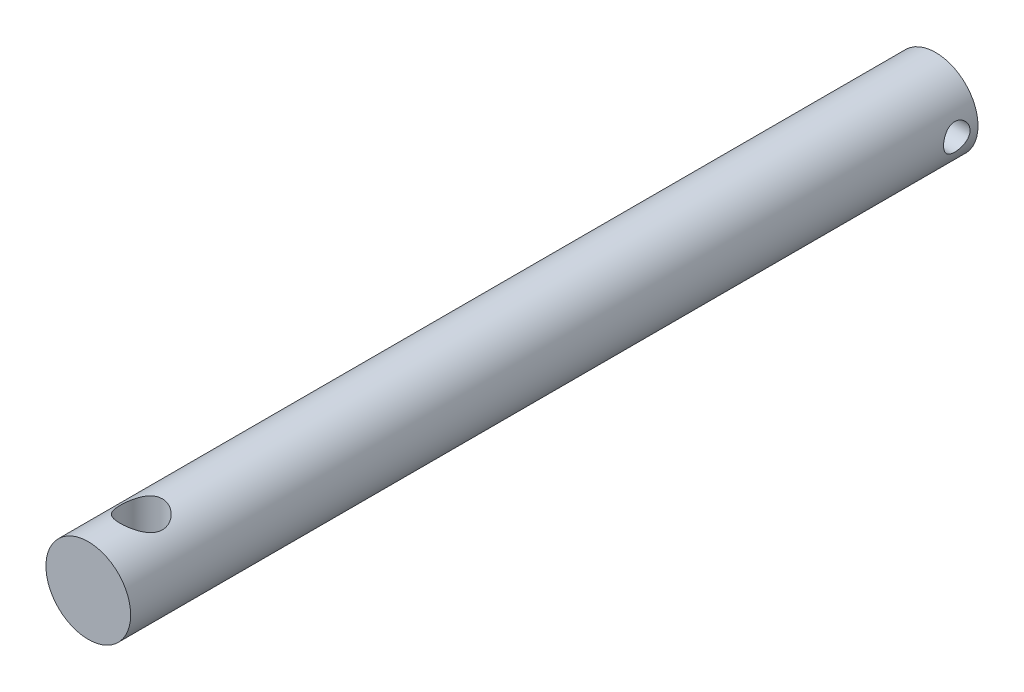
ISO-10303-21;
HEADER;
FILE_DESCRIPTION(('STEP AP214'),'2;1');
FILE_NAME('part.step','',(''),(''),'','','');
FILE_SCHEMA(('AUTOMOTIVE_DESIGN { 1 0 10303 214 1 1 1 1 }'));
ENDSEC;
DATA;
#1=APPLICATION_CONTEXT('core data for automotive mechanical design processes');
#2=APPLICATION_PROTOCOL_DEFINITION('international standard','automotive_design',2000,#1);
#3=PRODUCT_CONTEXT('',#1,'mechanical');
#4=PRODUCT('Part','Part','',(#3));
#5=PRODUCT_RELATED_PRODUCT_CATEGORY('part','',(#4));
#6=PRODUCT_DEFINITION_FORMATION('','',#4);
#7=PRODUCT_DEFINITION_CONTEXT('part definition',#1,'design');
#8=PRODUCT_DEFINITION('design','',#6,#7);
#9=PRODUCT_DEFINITION_SHAPE('','',#8);
#10=(LENGTH_UNIT() NAMED_UNIT(*) SI_UNIT(.MILLI.,.METRE.));
#11=(NAMED_UNIT(*) PLANE_ANGLE_UNIT() SI_UNIT($,.RADIAN.));
#12=(NAMED_UNIT(*) SI_UNIT($,.STERADIAN.) SOLID_ANGLE_UNIT());
#13=UNCERTAINTY_MEASURE_WITH_UNIT(LENGTH_MEASURE(1.E-05),#10,'distance_accuracy_value','');
#14=(GEOMETRIC_REPRESENTATION_CONTEXT(3) GLOBAL_UNCERTAINTY_ASSIGNED_CONTEXT((#13)) GLOBAL_UNIT_ASSIGNED_CONTEXT((#10,
#11,#12)) REPRESENTATION_CONTEXT('',''));
#15=CARTESIAN_POINT('',(0.,0.,0.));
#16=DIRECTION('',(0.,0.,1.));
#17=DIRECTION('',(1.,0.,0.));
#18=AXIS2_PLACEMENT_3D('',#15,#16,#17);
#19=CARTESIAN_POINT('',(0.,0.,160.));
#20=DIRECTION('',(0.,0.,-1.));
#21=DIRECTION('',(-1.,0.,0.));
#22=AXIS2_PLACEMENT_3D('',#19,#20,#21);
#23=CYLINDRICAL_SURFACE('',#22,8.);
#24=CARTESIAN_POINT('',(0.,8.,146.));
#25=CARTESIAN_POINT('',(-0.105191216468488,7.99999964432188,146.000000404848));
#26=CARTESIAN_POINT('',(-0.210389995368427,7.99792027620652,146.004154457315));
#27=CARTESIAN_POINT('',(-0.420011249701337,7.98965597150982,146.020722078099));
#28=CARTESIAN_POINT('',(-0.524433367425621,7.98346924887743,146.03313923957));
#29=CARTESIAN_POINT('',(-0.731828138370608,7.96713597659603,146.066113514695));
#30=CARTESIAN_POINT('',(-0.834798506711921,7.95698378017499,146.086682236657));
#31=CARTESIAN_POINT('',(-1.0384152051955,7.93298382243633,146.135717207556));
#32=CARTESIAN_POINT('',(-1.13906056699381,7.91913455043164,146.164186685064));
#33=CARTESIAN_POINT('',(-1.43561775388138,7.87265974292142,146.260748231118));
#34=CARTESIAN_POINT('',(-1.62719620658471,7.83501976471674,146.340162980847));
#35=CARTESIAN_POINT('',(-1.99392146995423,7.74982886318844,146.526289041088));
#36=CARTESIAN_POINT('',(-2.16906957469775,7.70227872135526,146.632998199381));
#37=CARTESIAN_POINT('',(-2.51002321260363,7.59825056785885,146.878069822599));
#38=CARTESIAN_POINT('',(-2.67462250306453,7.54140647262265,147.017956688194));
#39=CARTESIAN_POINT('',(-2.97911611963432,7.42640030348014,147.322075137586));
#40=CARTESIAN_POINT('',(-3.11899161990725,7.36823726296469,147.486325099043));
#41=CARTESIAN_POINT('',(-3.38102385527716,7.25195135134797,147.84997898713));
#42=CARTESIAN_POINT('',(-3.50096528772936,7.19418138823907,148.051121304275));
#43=CARTESIAN_POINT('',(-3.65378721735264,7.11709930290977,148.367934539954));
#44=CARTESIAN_POINT('',(-3.70022392693972,7.09299422837207,148.476094662807));
#45=CARTESIAN_POINT('',(-3.78359067078058,7.04887690211805,148.696800971079));
#46=CARTESIAN_POINT('',(-3.82052633371566,7.02886222858683,148.809344513922));
#47=CARTESIAN_POINT('',(-3.88251046204455,6.9948044998643,149.031194219306));
#48=CARTESIAN_POINT('',(-3.9081340887804,6.9804776446802,149.140296419165));
#49=CARTESIAN_POINT('',(-3.95018060072942,6.95677065788592,149.36074052282));
#50=CARTESIAN_POINT('',(-3.96660836750271,6.9473879018896,149.472081205753));
#51=CARTESIAN_POINT('',(-3.99001913809429,6.93396933490057,149.696006093466));
#52=CARTESIAN_POINT('',(-3.99700782997253,6.92993030376772,149.808589508088));
#53=CARTESIAN_POINT('',(-4.00144340059851,6.92737022415464,150.034000478039));
#54=CARTESIAN_POINT('',(-3.99889118971828,6.92884864921081,150.146828009047));
#55=CARTESIAN_POINT('',(-3.98516575152016,6.93675038555111,150.358164378446));
#56=CARTESIAN_POINT('',(-3.97506329407581,6.94255931040712,150.456767439572));
#57=CARTESIAN_POINT('',(-3.94763759493625,6.95818925294571,150.652651612166));
#58=CARTESIAN_POINT('',(-3.9303120853467,6.96801153072176,150.74993229852));
#59=CARTESIAN_POINT('',(-3.86777248849785,7.00304835203764,151.0387791329));
#60=CARTESIAN_POINT('',(-3.8119855502641,7.03383903740602,151.227495457081));
#61=CARTESIAN_POINT('',(-3.6728359957252,7.10749917506982,151.596946332771));
#62=CARTESIAN_POINT('',(-3.58886132884633,7.15063327143764,151.777392575348));
#63=CARTESIAN_POINT('',(-3.39616568981264,7.2441365265382,152.122530187015));
#64=CARTESIAN_POINT('',(-3.28743360222608,7.29450893132236,152.287214432065));
#65=CARTESIAN_POINT('',(-3.03227252755196,7.40452458073482,152.618082881705));
#66=CARTESIAN_POINT('',(-2.88281182497071,7.46453347888883,152.781809570708));
#67=CARTESIAN_POINT('',(-2.55818830727484,7.58191186589975,153.0829596065));
#68=CARTESIAN_POINT('',(-2.38301327894515,7.63928008344307,153.220370382475));
#69=CARTESIAN_POINT('',(-2.09944472683199,7.72027607686169,153.406753030214));
#70=CARTESIAN_POINT('',(-1.9989679987013,7.74696304862188,153.466681759753));
#71=CARTESIAN_POINT('',(-1.79256850112002,7.79730441532266,153.577766478777));
#72=CARTESIAN_POINT('',(-1.68664805204876,7.82096008757468,153.628926166398));
#73=CARTESIAN_POINT('',(-1.47010242051538,7.86454042959534,153.721919122373));
#74=CARTESIAN_POINT('',(-1.35947915341347,7.88446660078232,153.763756145133));
#75=CARTESIAN_POINT('',(-1.13432950721216,7.91999221203723,153.837619938552));
#76=CARTESIAN_POINT('',(-1.01980357880327,7.9355921498224,153.869647837759));
#77=CARTESIAN_POINT('',(-0.797438403015323,7.96087677585623,153.921226847855));
#78=CARTESIAN_POINT('',(-0.689830906854559,7.9709443603734,153.941591597057));
#79=CARTESIAN_POINT('',(-0.472998720376374,7.98674429615844,153.973446448242));
#80=CARTESIAN_POINT('',(-0.363774173887717,7.99247703065614,153.984937334737));
#81=CARTESIAN_POINT('',(-0.144648447401167,7.99944300548302,153.998890471544));
#82=CARTESIAN_POINT('',(-0.0347475425961409,8.00067796839692,154.001356178379));
#83=CARTESIAN_POINT('',(0.184837638972489,7.99861804620746,153.99723575789));
#84=CARTESIAN_POINT('',(0.294521925108022,7.99532336157662,153.990650031163));
#85=CARTESIAN_POINT('',(0.504259611746538,7.98472734940324,153.969376430473));
#86=CARTESIAN_POINT('',(0.604398259266984,7.97775776257091,153.955358930896));
#87=CARTESIAN_POINT('',(0.803035609307671,7.96021983565122,153.919863600336));
#88=CARTESIAN_POINT('',(0.901533743070591,7.94965027363514,153.898383236207));
#89=CARTESIAN_POINT('',(1.19351737727533,7.91289127905722,153.8230648264));
#90=CARTESIAN_POINT('',(1.38368108667205,7.88164133135127,153.758329859409));
#91=CARTESIAN_POINT('',(1.75558493783057,7.80736894774679,153.600001891094));
#92=CARTESIAN_POINT('',(1.93692876519228,7.76403545540106,153.505636690828));
#93=CARTESIAN_POINT('',(2.28183826656571,7.66975878800211,153.29156896574));
#94=CARTESIAN_POINT('',(2.44539632212196,7.61881237399843,153.171855647368));
#95=CARTESIAN_POINT('',(2.76706877708067,7.50833088367007,152.896966880297));
#96=CARTESIAN_POINT('',(2.92307134240143,7.44844369061623,152.739463462741));
#97=CARTESIAN_POINT('',(3.20744226426285,7.33048735856256,152.400264434745));
#98=CARTESIAN_POINT('',(3.33579150415336,7.27241950081065,152.218552228397));
#99=CARTESIAN_POINT('',(3.50772930633182,7.19028164087442,151.926005985578));
#100=CARTESIAN_POINT('',(3.56261578679478,7.16316684054652,151.822516241564));
#101=CARTESIAN_POINT('',(3.6633461615428,7.11217812644118,151.610481564684));
#102=CARTESIAN_POINT('',(3.70919441458264,7.08830265221425,151.501939099905));
#103=CARTESIAN_POINT('',(3.79131200961918,7.04472262103752,151.280578354636));
#104=CARTESIAN_POINT('',(3.82758904080802,7.02501471854545,151.167763590205));
#105=CARTESIAN_POINT('',(3.89012004539429,6.9905825381999,150.938647210928));
#106=CARTESIAN_POINT('',(3.91637557070638,6.9758574887497,150.822346138978));
#107=CARTESIAN_POINT('',(3.95643062416587,6.9532102561999,150.598587866837));
#108=CARTESIAN_POINT('',(3.97118378192521,6.94477079792059,150.491353167092));
#109=CARTESIAN_POINT('',(3.99195118317072,6.93285441469714,150.275772329799));
#110=CARTESIAN_POINT('',(3.99796634225491,6.92937696981658,150.167426309899));
#111=CARTESIAN_POINT('',(4.00116308319383,6.92753208063798,149.95059250327));
#112=CARTESIAN_POINT('',(3.99834777004019,6.92916284018069,149.842104779777));
#113=CARTESIAN_POINT('',(3.98394653809982,6.9374509348198,149.625938852886));
#114=CARTESIAN_POINT('',(3.97236097836303,6.94410806413885,149.518260616531));
#115=CARTESIAN_POINT('',(3.92770249100378,6.9695287958286,149.218199862959));
#116=CARTESIAN_POINT('',(3.88483285002043,6.99372760142387,149.027634132686));
#117=CARTESIAN_POINT('',(3.77270184038046,7.05483682415845,148.656731497447));
#118=CARTESIAN_POINT('',(3.70343198216887,7.09175132993569,148.476397904296));
#119=CARTESIAN_POINT('',(3.53526338936953,7.17714225279384,148.117511446486));
#120=CARTESIAN_POINT('',(3.43468670285355,7.22622883383996,147.939892224238));
#121=CARTESIAN_POINT('',(3.20860173383709,7.32941332742359,147.602898021723));
#122=CARTESIAN_POINT('',(3.08308048046464,7.38351383930109,147.443532601459));
#123=CARTESIAN_POINT('',(2.79282250805388,7.49849148240842,147.127437090961));
#124=CARTESIAN_POINT('',(2.62517402605098,7.55939328373464,146.973380070376));
#125=CARTESIAN_POINT('',(2.26458287075638,7.67511613929542,146.694931577187));
#126=CARTESIAN_POINT('',(2.0716266499056,7.72993390744395,146.570556094758));
#127=CARTESIAN_POINT('',(1.76603106757847,7.80335210517359,146.409095750585));
#128=CARTESIAN_POINT('',(1.66100410373828,7.82643367929071,146.359306358591));
#129=CARTESIAN_POINT('',(1.44639623629744,7.8689179624278,146.268851052999));
#130=CARTESIAN_POINT('',(1.33681760142932,7.88832247803741,146.228180657302));
#131=CARTESIAN_POINT('',(1.11415600876093,7.92283587265691,146.156523655566));
#132=CARTESIAN_POINT('',(1.00108129646084,7.93795411409434,146.125515928613));
#133=CARTESIAN_POINT('',(0.772189766950839,7.96347694583625,146.073489919984));
#134=CARTESIAN_POINT('',(0.65637467030461,7.97388441530453,146.052465536228));
#135=CARTESIAN_POINT('',(0.450433316283297,7.98781110043795,146.024420378801));
#136=CARTESIAN_POINT('',(0.360660623567805,7.99237392421377,146.015270610824));
#137=CARTESIAN_POINT('',(0.180593821057083,7.99846856848792,146.003060163622));
#138=CARTESIAN_POINT('',(0.0902996969389638,8.00000030532612,145.999999652465));
#139=CARTESIAN_POINT('',(0.,8.,146.));
#140=B_SPLINE_CURVE_WITH_KNOTS('',3,(#24,#25,#26,#27,#28,#29,#30,#31,#32,#33,#34,#35,#36,#37,
#38,#39,#40,#41,#42,#43,#44,#45,#46,#47,#48,#49,#50,#51,#52,#53,#54,#55,#56,#57,#58,#59,#60,#61,
#62,#63,#64,#65,#66,#67,#68,#69,#70,#71,#72,#73,#74,#75,#76,#77,#78,#79,#80,#81,#82,#83,#84,#85,
#86,#87,#88,#89,#90,#91,#92,#93,#94,#95,#96,#97,#98,#99,#100,#101,#102,#103,#104,#105,#106,#107,
#108,#109,#110,#111,#112,#113,#114,#115,#116,#117,#118,#119,#120,#121,#122,#123,#124,#125,#126,
#127,#128,#129,#130,#131,#132,#133,#134,#135,#136,#137,#138,#139),.UNSPECIFIED.,.T.,.F.,(4,2,2,
2,2,2,2,2,2,2,2,2,2,2,2,2,2,2,2,2,2,2,2,2,2,2,2,2,2,2,2,2,2,2,2,2,2,2,2,2,2,2,2,2,2,2,2,2,2,2,2,
2,2,2,2,2,2,4),(0.,0.315484235719913,0.631105747230255,0.947178346952281,1.26338029745355,
1.89263632058596,2.52184274094304,3.18911473348914,3.8568926492329,4.57645675584685,
4.93648208726458,5.29629363598335,5.63476191634053,5.97305035229577,6.31113484191768,
6.64918707308225,6.9466914865286,7.24428938086225,7.83905304157542,8.44767049128776,
9.05656173495714,9.74265853790342,10.4290822684957,10.7886699173095,11.1481055433964,
11.5073961555811,11.8666454155399,12.1961419049363,12.5256092612256,12.8549504227676,
13.184277008843,13.4879760335491,13.791778244799,14.3988188497914,15.0232162256701,
15.6478800144877,16.33388641032,17.0203655291613,17.3806820308649,17.7408243397693,
18.1006764355618,18.4604727825931,18.7857371805984,19.1109674938046,19.4360834615764,
19.7611861199665,20.3488209353336,20.9366448769134,21.5639619965908,22.1916061711246,
22.8955134356509,23.5997990605888,23.9548906509477,24.309807324981,24.6639426811876,
25.0178613011449,25.2886761616556,25.5594984967416),.UNSPECIFIED.);
#141=CARTESIAN_POINT('',(0.,8.,146.));
#142=VERTEX_POINT('',#141);
#143=EDGE_CURVE('E52',#142,#142,#140,.T.);
#144=ORIENTED_EDGE('',*,*,#143,.F.);
#145=EDGE_LOOP('',(#144));
#146=FACE_BOUND('',#145,.T.);
#147=CARTESIAN_POINT('',(0.,0.,0.));
#148=DIRECTION('',(0.,0.,1.));
#149=DIRECTION('',(1.,0.,0.));
#150=AXIS2_PLACEMENT_3D('',#147,#148,#149);
#151=CIRCLE('',#150,8.);
#152=CARTESIAN_POINT('',(8.,0.,0.));
#153=VERTEX_POINT('',#152);
#154=EDGE_CURVE('E47',#153,#153,#151,.T.);
#155=ORIENTED_EDGE('',*,*,#154,.T.);
#156=EDGE_LOOP('',(#155));
#157=FACE_BOUND('',#156,.T.);
#158=CARTESIAN_POINT('',(0.,0.,160.));
#159=DIRECTION('',(0.,0.,1.));
#160=DIRECTION('',(1.,0.,0.));
#161=AXIS2_PLACEMENT_3D('',#158,#159,#160);
#162=CIRCLE('',#161,8.);
#163=CARTESIAN_POINT('',(8.,0.,160.));
#164=VERTEX_POINT('',#163);
#165=EDGE_CURVE('E10',#164,#164,#162,.T.);
#166=ORIENTED_EDGE('',*,*,#165,.F.);
#167=EDGE_LOOP('',(#166));
#168=FACE_BOUND('',#167,.T.);
#169=CARTESIAN_POINT('',(0.,-8.,146.));
#170=CARTESIAN_POINT('',(0.105191216468488,-7.99999964432188,146.000000404848));
#171=CARTESIAN_POINT('',(0.210389995368427,-7.99792027620652,146.004154457315));
#172=CARTESIAN_POINT('',(0.420011249701337,-7.98965597150982,146.020722078099));
#173=CARTESIAN_POINT('',(0.524433367425621,-7.98346924887743,146.03313923957));
#174=CARTESIAN_POINT('',(0.731828138370608,-7.96713597659603,146.066113514695));
#175=CARTESIAN_POINT('',(0.834798506711921,-7.95698378017499,146.086682236657));
#176=CARTESIAN_POINT('',(1.0384152051955,-7.93298382243633,146.135717207556));
#177=CARTESIAN_POINT('',(1.13906056699381,-7.91913455043164,146.164186685064));
#178=CARTESIAN_POINT('',(1.43561775388138,-7.87265974292142,146.260748231118));
#179=CARTESIAN_POINT('',(1.62719620658471,-7.83501976471674,146.340162980847));
#180=CARTESIAN_POINT('',(1.99392146995423,-7.74982886318844,146.526289041088));
#181=CARTESIAN_POINT('',(2.16906957469775,-7.70227872135526,146.632998199381));
#182=CARTESIAN_POINT('',(2.51002321260363,-7.59825056785885,146.878069822599));
#183=CARTESIAN_POINT('',(2.67462250306453,-7.54140647262265,147.017956688194));
#184=CARTESIAN_POINT('',(2.97911611963432,-7.42640030348014,147.322075137586));
#185=CARTESIAN_POINT('',(3.11899161990725,-7.36823726296469,147.486325099043));
#186=CARTESIAN_POINT('',(3.38102385527716,-7.25195135134797,147.84997898713));
#187=CARTESIAN_POINT('',(3.50096528772936,-7.19418138823907,148.051121304275));
#188=CARTESIAN_POINT('',(3.65378721735264,-7.11709930290977,148.367934539954));
#189=CARTESIAN_POINT('',(3.70022392693972,-7.09299422837207,148.476094662807));
#190=CARTESIAN_POINT('',(3.78359067078058,-7.04887690211805,148.696800971079));
#191=CARTESIAN_POINT('',(3.82052633371566,-7.02886222858683,148.809344513922));
#192=CARTESIAN_POINT('',(3.88251046204455,-6.9948044998643,149.031194219306));
#193=CARTESIAN_POINT('',(3.9081340887804,-6.9804776446802,149.140296419165));
#194=CARTESIAN_POINT('',(3.95018060072942,-6.95677065788592,149.36074052282));
#195=CARTESIAN_POINT('',(3.96660836750271,-6.9473879018896,149.472081205753));
#196=CARTESIAN_POINT('',(3.99001913809429,-6.93396933490057,149.696006093466));
#197=CARTESIAN_POINT('',(3.99700782997253,-6.92993030376772,149.808589508088));
#198=CARTESIAN_POINT('',(4.00144340059851,-6.92737022415464,150.034000478039));
#199=CARTESIAN_POINT('',(3.99889118971828,-6.92884864921081,150.146828009047));
#200=CARTESIAN_POINT('',(3.98516575152016,-6.93675038555111,150.358164378446));
#201=CARTESIAN_POINT('',(3.97506329407581,-6.94255931040712,150.456767439572));
#202=CARTESIAN_POINT('',(3.94763759493625,-6.95818925294571,150.652651612166));
#203=CARTESIAN_POINT('',(3.9303120853467,-6.96801153072176,150.74993229852));
#204=CARTESIAN_POINT('',(3.86777248849785,-7.00304835203764,151.0387791329));
#205=CARTESIAN_POINT('',(3.8119855502641,-7.03383903740602,151.227495457081));
#206=CARTESIAN_POINT('',(3.6728359957252,-7.10749917506982,151.596946332771));
#207=CARTESIAN_POINT('',(3.58886132884633,-7.15063327143764,151.777392575348));
#208=CARTESIAN_POINT('',(3.39616568981264,-7.2441365265382,152.122530187015));
#209=CARTESIAN_POINT('',(3.28743360222608,-7.29450893132236,152.287214432065));
#210=CARTESIAN_POINT('',(3.03227252755196,-7.40452458073482,152.618082881705));
#211=CARTESIAN_POINT('',(2.88281182497071,-7.46453347888883,152.781809570708));
#212=CARTESIAN_POINT('',(2.55818830727484,-7.58191186589975,153.0829596065));
#213=CARTESIAN_POINT('',(2.38301327894515,-7.63928008344307,153.220370382475));
#214=CARTESIAN_POINT('',(2.09944472683199,-7.72027607686169,153.406753030214));
#215=CARTESIAN_POINT('',(1.9989679987013,-7.74696304862188,153.466681759753));
#216=CARTESIAN_POINT('',(1.79256850112002,-7.79730441532266,153.577766478777));
#217=CARTESIAN_POINT('',(1.68664805204876,-7.82096008757468,153.628926166398));
#218=CARTESIAN_POINT('',(1.47010242051538,-7.86454042959534,153.721919122373));
#219=CARTESIAN_POINT('',(1.35947915341347,-7.88446660078232,153.763756145133));
#220=CARTESIAN_POINT('',(1.13432950721216,-7.91999221203723,153.837619938552));
#221=CARTESIAN_POINT('',(1.01980357880327,-7.9355921498224,153.869647837759));
#222=CARTESIAN_POINT('',(0.797438403015323,-7.96087677585623,153.921226847855));
#223=CARTESIAN_POINT('',(0.689830906854559,-7.9709443603734,153.941591597057));
#224=CARTESIAN_POINT('',(0.472998720376374,-7.98674429615844,153.973446448242));
#225=CARTESIAN_POINT('',(0.363774173887717,-7.99247703065614,153.984937334737));
#226=CARTESIAN_POINT('',(0.144648447401167,-7.99944300548302,153.998890471544));
#227=CARTESIAN_POINT('',(0.0347475425961409,-8.00067796839692,154.001356178379));
#228=CARTESIAN_POINT('',(-0.184837638972489,-7.99861804620746,153.99723575789));
#229=CARTESIAN_POINT('',(-0.294521925108022,-7.99532336157662,153.990650031163));
#230=CARTESIAN_POINT('',(-0.504259611746538,-7.98472734940324,153.969376430473));
#231=CARTESIAN_POINT('',(-0.604398259266984,-7.97775776257091,153.955358930896));
#232=CARTESIAN_POINT('',(-0.803035609307671,-7.96021983565122,153.919863600336));
#233=CARTESIAN_POINT('',(-0.901533743070591,-7.94965027363514,153.898383236207));
#234=CARTESIAN_POINT('',(-1.19351737727533,-7.91289127905722,153.8230648264));
#235=CARTESIAN_POINT('',(-1.38368108667205,-7.88164133135127,153.758329859409));
#236=CARTESIAN_POINT('',(-1.75558493783057,-7.80736894774679,153.600001891094));
#237=CARTESIAN_POINT('',(-1.93692876519228,-7.76403545540106,153.505636690828));
#238=CARTESIAN_POINT('',(-2.28183826656571,-7.66975878800211,153.29156896574));
#239=CARTESIAN_POINT('',(-2.44539632212196,-7.61881237399843,153.171855647368));
#240=CARTESIAN_POINT('',(-2.76706877708067,-7.50833088367007,152.896966880297));
#241=CARTESIAN_POINT('',(-2.92307134240143,-7.44844369061623,152.739463462741));
#242=CARTESIAN_POINT('',(-3.20744226426285,-7.33048735856256,152.400264434745));
#243=CARTESIAN_POINT('',(-3.33579150415336,-7.27241950081065,152.218552228397));
#244=CARTESIAN_POINT('',(-3.50772930633182,-7.19028164087442,151.926005985578));
#245=CARTESIAN_POINT('',(-3.56261578679478,-7.16316684054652,151.822516241564));
#246=CARTESIAN_POINT('',(-3.6633461615428,-7.11217812644118,151.610481564684));
#247=CARTESIAN_POINT('',(-3.70919441458264,-7.08830265221425,151.501939099905));
#248=CARTESIAN_POINT('',(-3.79131200961918,-7.04472262103752,151.280578354636));
#249=CARTESIAN_POINT('',(-3.82758904080802,-7.02501471854545,151.167763590205));
#250=CARTESIAN_POINT('',(-3.89012004539429,-6.9905825381999,150.938647210928));
#251=CARTESIAN_POINT('',(-3.91637557070638,-6.9758574887497,150.822346138978));
#252=CARTESIAN_POINT('',(-3.95643062416587,-6.9532102561999,150.598587866837));
#253=CARTESIAN_POINT('',(-3.97118378192521,-6.94477079792059,150.491353167092));
#254=CARTESIAN_POINT('',(-3.99195118317072,-6.93285441469714,150.275772329799));
#255=CARTESIAN_POINT('',(-3.99796634225491,-6.92937696981658,150.167426309899));
#256=CARTESIAN_POINT('',(-4.00116308319383,-6.92753208063798,149.95059250327));
#257=CARTESIAN_POINT('',(-3.99834777004019,-6.92916284018069,149.842104779777));
#258=CARTESIAN_POINT('',(-3.98394653809982,-6.9374509348198,149.625938852886));
#259=CARTESIAN_POINT('',(-3.97236097836303,-6.94410806413885,149.518260616531));
#260=CARTESIAN_POINT('',(-3.92770249100378,-6.9695287958286,149.218199862959));
#261=CARTESIAN_POINT('',(-3.88483285002043,-6.99372760142387,149.027634132686));
#262=CARTESIAN_POINT('',(-3.77270184038046,-7.05483682415845,148.656731497447));
#263=CARTESIAN_POINT('',(-3.70343198216887,-7.09175132993569,148.476397904296));
#264=CARTESIAN_POINT('',(-3.53526338936953,-7.17714225279384,148.117511446486));
#265=CARTESIAN_POINT('',(-3.43468670285355,-7.22622883383996,147.939892224238));
#266=CARTESIAN_POINT('',(-3.20860173383709,-7.32941332742359,147.602898021723));
#267=CARTESIAN_POINT('',(-3.08308048046464,-7.38351383930109,147.443532601459));
#268=CARTESIAN_POINT('',(-2.79282250805388,-7.49849148240842,147.127437090961));
#269=CARTESIAN_POINT('',(-2.62517402605098,-7.55939328373464,146.973380070376));
#270=CARTESIAN_POINT('',(-2.26458287075638,-7.67511613929542,146.694931577187));
#271=CARTESIAN_POINT('',(-2.0716266499056,-7.72993390744395,146.570556094758));
#272=CARTESIAN_POINT('',(-1.76603106757847,-7.80335210517359,146.409095750585));
#273=CARTESIAN_POINT('',(-1.66100410373828,-7.82643367929071,146.359306358591));
#274=CARTESIAN_POINT('',(-1.44639623629744,-7.8689179624278,146.268851052999));
#275=CARTESIAN_POINT('',(-1.33681760142932,-7.88832247803741,146.228180657302));
#276=CARTESIAN_POINT('',(-1.11415600876093,-7.92283587265691,146.156523655566));
#277=CARTESIAN_POINT('',(-1.00108129646084,-7.93795411409434,146.125515928613));
#278=CARTESIAN_POINT('',(-0.772189766950839,-7.96347694583625,146.073489919984));
#279=CARTESIAN_POINT('',(-0.65637467030461,-7.97388441530453,146.052465536228));
#280=CARTESIAN_POINT('',(-0.450433316283297,-7.98781110043795,146.024420378801));
#281=CARTESIAN_POINT('',(-0.360660623567805,-7.99237392421377,146.015270610824));
#282=CARTESIAN_POINT('',(-0.180593821057083,-7.99846856848792,146.003060163622));
#283=CARTESIAN_POINT('',(-0.0902996969389638,-8.00000030532612,145.999999652465));
#284=CARTESIAN_POINT('',(0.,-8.,146.));
#285=B_SPLINE_CURVE_WITH_KNOTS('',3,(#169,#170,#171,#172,#173,#174,#175,#176,#177,#178,#179,
#180,#181,#182,#183,#184,#185,#186,#187,#188,#189,#190,#191,#192,#193,#194,#195,#196,#197,#198,
#199,#200,#201,#202,#203,#204,#205,#206,#207,#208,#209,#210,#211,#212,#213,#214,#215,#216,#217,
#218,#219,#220,#221,#222,#223,#224,#225,#226,#227,#228,#229,#230,#231,#232,#233,#234,#235,#236,
#237,#238,#239,#240,#241,#242,#243,#244,#245,#246,#247,#248,#249,#250,#251,#252,#253,#254,#255,
#256,#257,#258,#259,#260,#261,#262,#263,#264,#265,#266,#267,#268,#269,#270,#271,#272,#273,#274,
#275,#276,#277,#278,#279,#280,#281,#282,#283,#284),.UNSPECIFIED.,.T.,.F.,(4,2,2,2,2,2,2,2,2,2,2,
2,2,2,2,2,2,2,2,2,2,2,2,2,2,2,2,2,2,2,2,2,2,2,2,2,2,2,2,2,2,2,2,2,2,2,2,2,2,2,2,2,2,2,2,2,2,4),
(0.,0.315484235719913,0.631105747230255,0.947178346952281,1.26338029745355,1.89263632058596,
2.52184274094304,3.18911473348914,3.8568926492329,4.57645675584685,4.93648208726458,
5.29629363598335,5.63476191634053,5.97305035229577,6.31113484191768,6.64918707308225,
6.9466914865286,7.24428938086225,7.83905304157542,8.44767049128776,9.05656173495714,
9.74265853790342,10.4290822684957,10.7886699173095,11.1481055433964,11.5073961555811,
11.8666454155399,12.1961419049363,12.5256092612256,12.8549504227676,13.184277008843,
13.4879760335491,13.791778244799,14.3988188497914,15.0232162256701,15.6478800144877,
16.33388641032,17.0203655291613,17.3806820308649,17.7408243397693,18.1006764355618,
18.4604727825931,18.7857371805984,19.1109674938046,19.4360834615764,19.7611861199665,
20.3488209353336,20.9366448769134,21.5639619965908,22.1916061711246,22.8955134356509,
23.5997990605888,23.9548906509477,24.309807324981,24.6639426811876,25.0178613011449,
25.2886761616556,25.5594984967416),.UNSPECIFIED.);
#286=CARTESIAN_POINT('',(0.,-8.,146.));
#287=VERTEX_POINT('',#286);
#288=EDGE_CURVE('E57',#287,#287,#285,.T.);
#289=ORIENTED_EDGE('',*,*,#288,.F.);
#290=EDGE_LOOP('',(#289));
#291=FACE_BOUND('',#290,.T.);
#292=CARTESIAN_POINT('',(8.,0.,6.5));
#293=CARTESIAN_POINT('',(7.9999993175598,-0.136878370349093,6.49999910682485));
#294=CARTESIAN_POINT('',(7.99645389969682,-0.273766105005719,6.48872154611109));
#295=CARTESIAN_POINT('',(7.98265788177613,-0.543538419176897,6.44402751692153));
#296=CARTESIAN_POINT('',(7.97240576399719,-0.676422085451815,6.41060603727128));
#297=CARTESIAN_POINT('',(7.94631631395819,-0.934257087301613,6.32286125760852));
#298=CARTESIAN_POINT('',(7.9304876299805,-1.05922035397161,6.26857031069407));
#299=CARTESIAN_POINT('',(7.89487938322185,-1.29826960469292,6.14076536464334));
#300=CARTESIAN_POINT('',(7.8750991979981,-1.41235387088977,6.06724833643883));
#301=CARTESIAN_POINT('',(7.83300427480565,-1.62993066990456,5.90068801596528));
#302=CARTESIAN_POINT('',(7.81063431853978,-1.73304005631332,5.80715822987786));
#303=CARTESIAN_POINT('',(7.76620092748417,-1.92239476407399,5.6042632151729));
#304=CARTESIAN_POINT('',(7.74413755046914,-2.00863694579739,5.4948950450109));
#305=CARTESIAN_POINT('',(7.70222289396344,-2.16388672966227,5.26011087238383));
#306=CARTESIAN_POINT('',(7.68243976603591,-2.23241568300258,5.13436504494556));
#307=CARTESIAN_POINT('',(7.64815603598469,-2.34719482153343,4.87241537003625));
#308=CARTESIAN_POINT('',(7.63365404257377,-2.39345087543889,4.73621428841214));
#309=CARTESIAN_POINT('',(7.61215213969001,-2.46096919860067,4.46154384509588));
#310=CARTESIAN_POINT('',(7.60493945859016,-2.48294220015729,4.32326631272229));
#311=CARTESIAN_POINT('',(7.59820110281901,-2.50349110073976,4.04481376217621));
#312=CARTESIAN_POINT('',(7.59867338454668,-2.50207321991544,3.90463925835668));
#313=CARTESIAN_POINT('',(7.60706378150876,-2.47643649465478,3.63225107946203));
#314=CARTESIAN_POINT('',(7.61468683491897,-2.45312115738766,3.49994174827687));
#315=CARTESIAN_POINT('',(7.63604051304978,-2.38581626711252,3.24121568692531));
#316=CARTESIAN_POINT('',(7.6497717868623,-2.34182451689101,3.1147995845824));
#317=CARTESIAN_POINT('',(7.68202088028593,-2.23377749362554,2.86929611113473));
#318=CARTESIAN_POINT('',(7.70060569321649,-2.16943851324164,2.75034277861603));
#319=CARTESIAN_POINT('',(7.7404371316014,-2.02272041475696,2.52462446424175));
#320=CARTESIAN_POINT('',(7.76168444789102,-1.94033661043155,2.41786265949258));
#321=CARTESIAN_POINT('',(7.80563055600986,-1.75543390836425,2.21445011316602));
#322=CARTESIAN_POINT('',(7.82835139211391,-1.65216914118563,2.11848088444063));
#323=CARTESIAN_POINT('',(7.87183141519161,-1.43072881619106,1.94505621284064));
#324=CARTESIAN_POINT('',(7.89259045676745,-1.31255215469804,1.86760214156158));
#325=CARTESIAN_POINT('',(7.93002589780382,-1.06332922093091,1.73294462279745));
#326=CARTESIAN_POINT('',(7.94666921296415,-0.932189813838559,1.67590372907206));
#327=CARTESIAN_POINT('',(7.97375911657108,-0.661535955565288,1.58489399829687));
#328=CARTESIAN_POINT('',(7.98420758650304,-0.522024061449217,1.55091815552321));
#329=CARTESIAN_POINT('',(7.99742778790027,-0.24437031458069,1.50816391484204));
#330=CARTESIAN_POINT('',(8.00048045790873,-0.106383697577687,1.49846291281295));
#331=CARTESIAN_POINT('',(7.99939599461967,0.169260611465171,1.50193245327466));
#332=CARTESIAN_POINT('',(7.9952599116227,0.306918348613017,1.51509965464522));
#333=CARTESIAN_POINT('',(7.98044727539523,0.574438665951697,1.56319118521277));
#334=CARTESIAN_POINT('',(7.96993586221374,0.704409956841872,1.59756653522497));
#335=CARTESIAN_POINT('',(7.94360242758579,0.956703857722752,1.68642870473343));
#336=CARTESIAN_POINT('',(7.92777975028687,1.07902552089812,1.74091800805002));
#337=CARTESIAN_POINT('',(7.89197085518848,1.31586481334438,1.86994643309737));
#338=CARTESIAN_POINT('',(7.87189253635335,1.43011947957558,1.94494197499362));
#339=CARTESIAN_POINT('',(7.82986820006859,1.64473170192052,2.11230642023485));
#340=CARTESIAN_POINT('',(7.80792167695774,1.7450854760879,2.20468003548928));
#341=CARTESIAN_POINT('',(7.76353989766283,1.93317492583804,2.4085177801042));
#342=CARTESIAN_POINT('',(7.74111973412883,2.02025304679062,2.52059332747845));
#343=CARTESIAN_POINT('',(7.69923894191212,2.17442500490303,2.75825323275355));
#344=CARTESIAN_POINT('',(7.67977826622621,2.24151915946859,2.88383737605397));
#345=CARTESIAN_POINT('',(7.64623564661738,2.35340166961084,3.14469034574095));
#346=CARTESIAN_POINT('',(7.63213292713749,2.39827639112025,3.27991929887144));
#347=CARTESIAN_POINT('',(7.6110234168862,2.4644578863618,3.55654498649724));
#348=CARTESIAN_POINT('',(7.60401392602456,2.48577362827989,3.69793935268706));
#349=CARTESIAN_POINT('',(7.59816585427753,2.50358812316251,3.97600817516085));
#350=CARTESIAN_POINT('',(7.59897209200284,2.50116559243271,4.11260690769484));
#351=CARTESIAN_POINT('',(7.60780180751807,2.47417636257668,4.38334916988388));
#352=CARTESIAN_POINT('',(7.61582494863208,2.44961069645024,4.51749281377347));
#353=CARTESIAN_POINT('',(7.6379362836678,2.37975459827235,4.77758807918378));
#354=CARTESIAN_POINT('',(7.65193396380514,2.33477284812016,4.90363088218672));
#355=CARTESIAN_POINT('',(7.68439408509128,2.22560454669999,5.14648082706801));
#356=CARTESIAN_POINT('',(7.70285743429343,2.16141408888473,5.26328608415681));
#357=CARTESIAN_POINT('',(7.74306974067005,2.01271350026986,5.48929194087963));
#358=CARTESIAN_POINT('',(7.76491897845913,1.92750667048264,5.59801625900048));
#359=CARTESIAN_POINT('',(7.8089799764242,1.7404179928096,5.799972656224));
#360=CARTESIAN_POINT('',(7.83119183213309,1.63853168468878,5.89320057798212));
#361=CARTESIAN_POINT('',(7.87434543904947,1.41697332564669,6.06456507672586));
#362=CARTESIAN_POINT('',(7.89522203461345,1.29682914897477,6.1421094728999));
#363=CARTESIAN_POINT('',(7.93253538593756,1.0445582760273,6.27579783027891));
#364=CARTESIAN_POINT('',(7.94897388631644,0.912436315590896,6.33195020428367));
#365=CARTESIAN_POINT('',(7.97441301466941,0.651495270747956,6.41718273521693));
#366=CARTESIAN_POINT('',(7.98392481612283,0.523340674225092,6.44814973461067));
#367=CARTESIAN_POINT('',(7.99671800680967,0.263459790880494,6.48955671993543));
#368=CARTESIAN_POINT('',(8.00000065679286,0.131734232279349,6.50000085960801));
#369=CARTESIAN_POINT('',(8.,0.,6.5));
#370=B_SPLINE_CURVE_WITH_KNOTS('',3,(#292,#293,#294,#295,#296,#297,#298,#299,#300,#301,#302,
#303,#304,#305,#306,#307,#308,#309,#310,#311,#312,#313,#314,#315,#316,#317,#318,#319,#320,#321,
#322,#323,#324,#325,#326,#327,#328,#329,#330,#331,#332,#333,#334,#335,#336,#337,#338,#339,#340,
#341,#342,#343,#344,#345,#346,#347,#348,#349,#350,#351,#352,#353,#354,#355,#356,#357,#358,#359,
#360,#361,#362,#363,#364,#365,#366,#367,#368,#369),.UNSPECIFIED.,.T.,.F.,(4,2,2,2,2,2,2,2,2,2,2,
2,2,2,2,2,2,2,2,2,2,2,2,2,2,2,2,2,2,2,2,2,2,2,2,2,2,2,4),(0.,0.41015089886502,0.820394646698133,
1.23000495840487,1.63967984311678,2.06075644390317,2.48191134862552,2.91347542494988,
3.34492572559054,3.7633830033442,4.18172900590276,4.58353834844338,4.98539039958126,
5.3931128544109,5.80094132020717,6.227334945592,6.65376014826606,7.0835092137954,
7.51312768989108,7.92615137096475,8.33911471298725,8.74181253445744,9.14456010068999,
9.55712649476686,9.96980491418519,10.3988355742628,10.8278594196742,11.2552023150671,
11.6823824779468,12.0902440696666,12.4980866352126,12.8999582681244,13.3019116867944,
13.7195902803182,14.1373807476578,14.5688133627192,15.0000761335177,15.3948927332218,
15.7896294154519),.UNSPECIFIED.);
#371=CARTESIAN_POINT('',(8.,0.,6.5));
#372=VERTEX_POINT('',#371);
#373=EDGE_CURVE('E40',#372,#372,#370,.T.);
#374=ORIENTED_EDGE('',*,*,#373,.F.);
#375=EDGE_LOOP('',(#374));
#376=FACE_BOUND('',#375,.T.);
#377=ADVANCED_FACE('F36',(#146,#157,#168,#291,#376),#23,.T.);
#378=CARTESIAN_POINT('',(0.,0.,160.));
#379=DIRECTION('',(0.,0.,1.));
#380=DIRECTION('',(1.,0.,0.));
#381=AXIS2_PLACEMENT_3D('',#378,#379,#380);
#382=PLANE('',#381);
#383=ORIENTED_EDGE('',*,*,#165,.T.);
#384=EDGE_LOOP('',(#383));
#385=FACE_BOUND('',#384,.T.);
#386=ADVANCED_FACE('F73',(#385),#382,.T.);
#387=CARTESIAN_POINT('',(0.,0.,0.));
#388=DIRECTION('',(0.,0.,1.));
#389=DIRECTION('',(1.,0.,0.));
#390=AXIS2_PLACEMENT_3D('',#387,#388,#389);
#391=PLANE('',#390);
#392=ORIENTED_EDGE('',*,*,#154,.F.);
#393=EDGE_LOOP('',(#392));
#394=FACE_BOUND('',#393,.T.);
#395=ADVANCED_FACE('F69',(#394),#391,.F.);
#396=CARTESIAN_POINT('',(0.,120.,150.));
#397=DIRECTION('',(0.,-1.,0.));
#398=DIRECTION('',(0.,0.,-1.));
#399=AXIS2_PLACEMENT_3D('',#396,#397,#398);
#400=CYLINDRICAL_SURFACE('',#399,4.00000000000001);
#401=ORIENTED_EDGE('',*,*,#288,.T.);
#402=EDGE_LOOP('',(#401));
#403=FACE_BOUND('',#402,.T.);
#404=ORIENTED_EDGE('',*,*,#143,.T.);
#405=EDGE_LOOP('',(#404));
#406=FACE_BOUND('',#405,.T.);
#407=ADVANCED_FACE('F64',(#403,#406),#400,.F.);
#408=CARTESIAN_POINT('',(10.,0.,4.));
#409=DIRECTION('',(-1.,0.,0.));
#410=DIRECTION('',(0.,0.,1.));
#411=AXIS2_PLACEMENT_3D('',#408,#409,#410);
#412=CYLINDRICAL_SURFACE('',#411,2.5);
#413=CARTESIAN_POINT('',(0.,0.,4.));
#414=DIRECTION('',(1.,0.,0.));
#415=DIRECTION('',(0.,0.,-1.));
#416=AXIS2_PLACEMENT_3D('',#413,#414,#415);
#417=CIRCLE('',#416,2.5);
#418=CARTESIAN_POINT('',(0.,0.,1.5));
#419=VERTEX_POINT('',#418);
#420=EDGE_CURVE('E55',#419,#419,#417,.T.);
#421=ORIENTED_EDGE('',*,*,#420,.F.);
#422=EDGE_LOOP('',(#421));
#423=FACE_BOUND('',#422,.T.);
#424=ORIENTED_EDGE('',*,*,#373,.T.);
#425=EDGE_LOOP('',(#424));
#426=FACE_BOUND('',#425,.T.);
#427=ADVANCED_FACE('F68',(#423,#426),#412,.F.);
#428=CARTESIAN_POINT('',(0.,0.,4.));
#429=DIRECTION('',(1.,0.,0.));
#430=DIRECTION('',(0.,0.,-1.));
#431=AXIS2_PLACEMENT_3D('',#428,#429,#430);
#432=PLANE('',#431);
#433=ORIENTED_EDGE('',*,*,#420,.T.);
#434=EDGE_LOOP('',(#433));
#435=FACE_BOUND('',#434,.T.);
#436=ADVANCED_FACE('F98',(#435),#432,.T.);
#437=CLOSED_SHELL('',(#377,#386,#395,#407,#427,#436));
#438=MANIFOLD_SOLID_BREP('B2',#437);
#439=ADVANCED_BREP_SHAPE_REPRESENTATION('',(#18,#438),#14);
#440=SHAPE_DEFINITION_REPRESENTATION(#9,#439);
ENDSEC;
END-ISO-10303-21;
